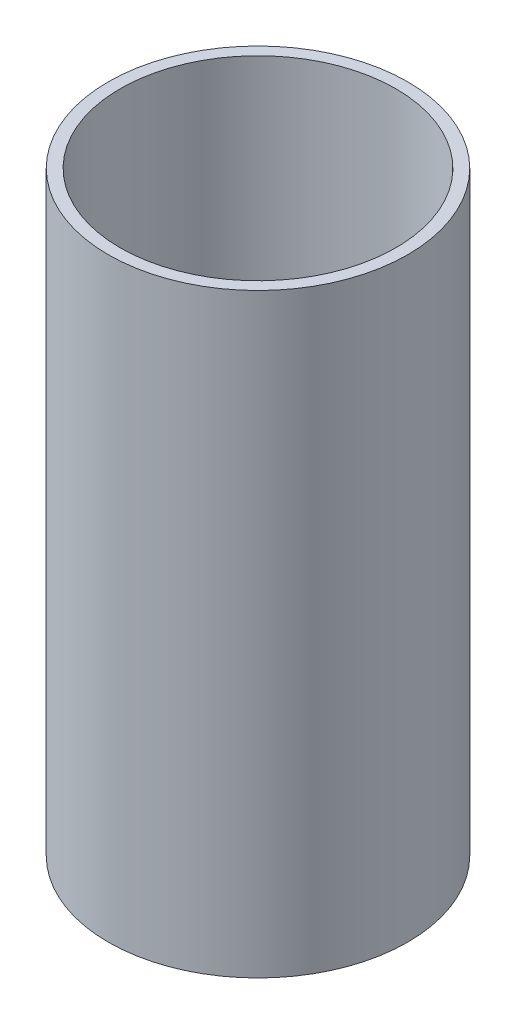
ISO-10303-21;
HEADER;
FILE_DESCRIPTION(('STEP AP214'),'2;1');
FILE_NAME('part.step','',(''),(''),'','','');
FILE_SCHEMA(('AUTOMOTIVE_DESIGN { 1 0 10303 214 1 1 1 1 }'));
ENDSEC;
DATA;
#1=APPLICATION_CONTEXT('core data for automotive mechanical design processes');
#2=APPLICATION_PROTOCOL_DEFINITION('international standard','automotive_design',2000,#1);
#3=PRODUCT_CONTEXT('',#1,'mechanical');
#4=PRODUCT('Part','Part','',(#3));
#5=PRODUCT_RELATED_PRODUCT_CATEGORY('part','',(#4));
#6=PRODUCT_DEFINITION_FORMATION('','',#4);
#7=PRODUCT_DEFINITION_CONTEXT('part definition',#1,'design');
#8=PRODUCT_DEFINITION('design','',#6,#7);
#9=PRODUCT_DEFINITION_SHAPE('','',#8);
#10=(LENGTH_UNIT() NAMED_UNIT(*) SI_UNIT(.MILLI.,.METRE.));
#11=(NAMED_UNIT(*) PLANE_ANGLE_UNIT() SI_UNIT($,.RADIAN.));
#12=(NAMED_UNIT(*) SI_UNIT($,.STERADIAN.) SOLID_ANGLE_UNIT());
#13=UNCERTAINTY_MEASURE_WITH_UNIT(LENGTH_MEASURE(1.E-05),#10,'distance_accuracy_value','');
#14=(GEOMETRIC_REPRESENTATION_CONTEXT(3) GLOBAL_UNCERTAINTY_ASSIGNED_CONTEXT((#13)) GLOBAL_UNIT_ASSIGNED_CONTEXT((#10,
#11,#12)) REPRESENTATION_CONTEXT('',''));
#15=CARTESIAN_POINT('',(0.,0.,0.));
#16=DIRECTION('',(0.,0.,1.));
#17=DIRECTION('',(1.,0.,0.));
#18=AXIS2_PLACEMENT_3D('',#15,#16,#17);
#19=CARTESIAN_POINT('',(0.,100.,0.));
#20=DIRECTION('',(0.,-1.,0.));
#21=DIRECTION('',(0.,0.,-1.));
#22=AXIS2_PLACEMENT_3D('',#19,#20,#21);
#23=CYLINDRICAL_SURFACE('',#22,23.15);
#24=CARTESIAN_POINT('',(0.,100.,0.));
#25=DIRECTION('',(0.,1.,0.));
#26=DIRECTION('',(0.,0.,1.));
#27=AXIS2_PLACEMENT_3D('',#24,#25,#26);
#28=CIRCLE('',#27,23.15);
#29=CARTESIAN_POINT('',(0.,100.,23.15));
#30=VERTEX_POINT('',#29);
#31=EDGE_CURVE('E43',#30,#30,#28,.T.);
#32=ORIENTED_EDGE('',*,*,#31,.T.);
#33=EDGE_LOOP('',(#32));
#34=FACE_BOUND('',#33,.T.);
#35=CARTESIAN_POINT('',(0.,3.,0.));
#36=DIRECTION('',(0.,-1.,0.));
#37=DIRECTION('',(0.,0.,-1.));
#38=AXIS2_PLACEMENT_3D('',#35,#36,#37);
#39=CIRCLE('',#38,23.15);
#40=CARTESIAN_POINT('',(0.,3.,-23.15));
#41=VERTEX_POINT('',#40);
#42=EDGE_CURVE('E34',#41,#41,#39,.T.);
#43=ORIENTED_EDGE('',*,*,#42,.T.);
#44=EDGE_LOOP('',(#43));
#45=FACE_BOUND('',#44,.T.);
#46=ADVANCED_FACE('F30',(#34,#45),#23,.F.);
#47=CARTESIAN_POINT('',(0.,100.,0.));
#48=DIRECTION('',(0.,1.,0.));
#49=DIRECTION('',(0.,0.,1.));
#50=AXIS2_PLACEMENT_3D('',#47,#48,#49);
#51=PLANE('',#50);
#52=CARTESIAN_POINT('',(0.,100.,0.));
#53=DIRECTION('',(0.,1.,0.));
#54=DIRECTION('',(0.,0.,1.));
#55=AXIS2_PLACEMENT_3D('',#52,#53,#54);
#56=CIRCLE('',#55,25.15);
#57=CARTESIAN_POINT('',(0.,100.,25.15));
#58=VERTEX_POINT('',#57);
#59=EDGE_CURVE('E10',#58,#58,#56,.T.);
#60=ORIENTED_EDGE('',*,*,#59,.T.);
#61=EDGE_LOOP('',(#60));
#62=FACE_BOUND('',#61,.T.);
#63=ORIENTED_EDGE('',*,*,#31,.F.);
#64=EDGE_LOOP('',(#63));
#65=FACE_BOUND('',#64,.T.);
#66=ADVANCED_FACE('F62',(#62,#65),#51,.T.);
#67=CARTESIAN_POINT('',(0.,0.,0.));
#68=DIRECTION('',(0.,1.,0.));
#69=DIRECTION('',(0.,0.,1.));
#70=AXIS2_PLACEMENT_3D('',#67,#68,#69);
#71=PLANE('',#70);
#72=CARTESIAN_POINT('',(0.,0.,0.));
#73=DIRECTION('',(0.,1.,0.));
#74=DIRECTION('',(0.,0.,1.));
#75=AXIS2_PLACEMENT_3D('',#72,#73,#74);
#76=CIRCLE('',#75,25.15);
#77=CARTESIAN_POINT('',(0.,0.,25.15));
#78=VERTEX_POINT('',#77);
#79=EDGE_CURVE('E38',#78,#78,#76,.T.);
#80=ORIENTED_EDGE('',*,*,#79,.F.);
#81=EDGE_LOOP('',(#80));
#82=FACE_BOUND('',#81,.T.);
#83=ADVANCED_FACE('F58',(#82),#71,.F.);
#84=CARTESIAN_POINT('',(0.,100.,0.));
#85=DIRECTION('',(0.,-1.,0.));
#86=DIRECTION('',(0.,0.,-1.));
#87=AXIS2_PLACEMENT_3D('',#84,#85,#86);
#88=CYLINDRICAL_SURFACE('',#87,25.15);
#89=ORIENTED_EDGE('',*,*,#79,.T.);
#90=EDGE_LOOP('',(#89));
#91=FACE_BOUND('',#90,.T.);
#92=ORIENTED_EDGE('',*,*,#59,.F.);
#93=EDGE_LOOP('',(#92));
#94=FACE_BOUND('',#93,.T.);
#95=ADVANCED_FACE('F32',(#91,#94),#88,.T.);
#96=CARTESIAN_POINT('',(0.,3.,0.));
#97=DIRECTION('',(0.,-1.,0.));
#98=DIRECTION('',(0.,0.,-1.));
#99=AXIS2_PLACEMENT_3D('',#96,#97,#98);
#100=PLANE('',#99);
#101=ORIENTED_EDGE('',*,*,#42,.F.);
#102=EDGE_LOOP('',(#101));
#103=FACE_BOUND('',#102,.T.);
#104=ADVANCED_FACE('F52',(#103),#100,.F.);
#105=CLOSED_SHELL('',(#46,#66,#83,#95,#104));
#106=MANIFOLD_SOLID_BREP('B2',#105);
#107=ADVANCED_BREP_SHAPE_REPRESENTATION('',(#18,#106),#14);
#108=SHAPE_DEFINITION_REPRESENTATION(#9,#107);
ENDSEC;
END-ISO-10303-21;
